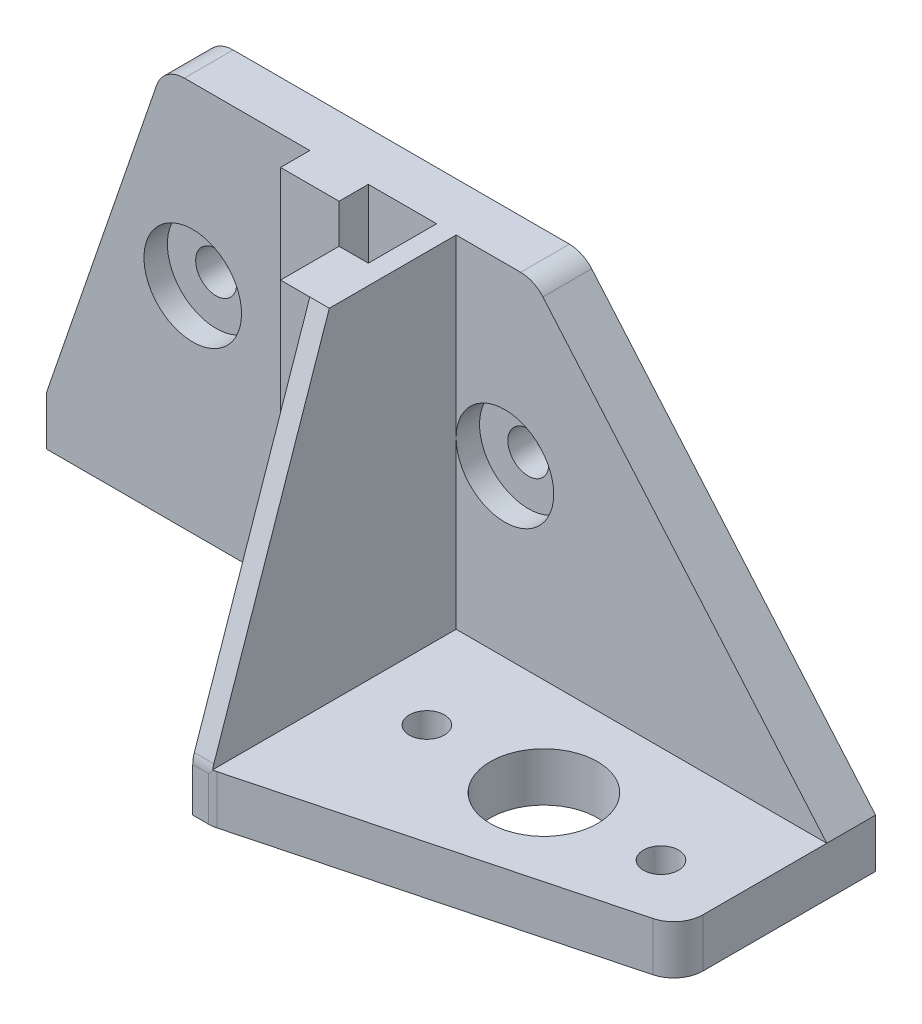
ISO-10303-21;
HEADER;
FILE_DESCRIPTION(('STEP AP214'),'2;1');
FILE_NAME('part.step','',(''),(''),'','','');
FILE_SCHEMA(('AUTOMOTIVE_DESIGN { 1 0 10303 214 1 1 1 1 }'));
ENDSEC;
DATA;
#1=APPLICATION_CONTEXT('core data for automotive mechanical design processes');
#2=APPLICATION_PROTOCOL_DEFINITION('international standard','automotive_design',2000,#1);
#3=PRODUCT_CONTEXT('',#1,'mechanical');
#4=PRODUCT('Part','Part','',(#3));
#5=PRODUCT_RELATED_PRODUCT_CATEGORY('part','',(#4));
#6=PRODUCT_DEFINITION_FORMATION('','',#4);
#7=PRODUCT_DEFINITION_CONTEXT('part definition',#1,'design');
#8=PRODUCT_DEFINITION('design','',#6,#7);
#9=PRODUCT_DEFINITION_SHAPE('','',#8);
#10=(LENGTH_UNIT() NAMED_UNIT(*) SI_UNIT(.MILLI.,.METRE.));
#11=(NAMED_UNIT(*) PLANE_ANGLE_UNIT() SI_UNIT($,.RADIAN.));
#12=(NAMED_UNIT(*) SI_UNIT($,.STERADIAN.) SOLID_ANGLE_UNIT());
#13=UNCERTAINTY_MEASURE_WITH_UNIT(LENGTH_MEASURE(1.E-05),#10,'distance_accuracy_value','');
#14=(GEOMETRIC_REPRESENTATION_CONTEXT(3) GLOBAL_UNCERTAINTY_ASSIGNED_CONTEXT((#13)) GLOBAL_UNIT_ASSIGNED_CONTEXT((#10,
#11,#12)) REPRESENTATION_CONTEXT('',''));
#15=CARTESIAN_POINT('',(0.,0.,0.));
#16=DIRECTION('',(0.,0.,1.));
#17=DIRECTION('',(1.,0.,0.));
#18=AXIS2_PLACEMENT_3D('',#15,#16,#17);
#19=CARTESIAN_POINT('',(-40.,0.,0.));
#20=DIRECTION('',(1.,0.,0.));
#21=DIRECTION('',(0.,0.,-1.));
#22=AXIS2_PLACEMENT_3D('',#19,#20,#21);
#23=PLANE('',#22);
#24=DIRECTION('',(0.,0.,-1.));
#25=VECTOR('',#24,1.);
#26=CARTESIAN_POINT('',(-40.,0.,0.));
#27=LINE('',#26,#25);
#28=CARTESIAN_POINT('',(-40.,0.,-18.));
#29=VERTEX_POINT('',#28);
#30=CARTESIAN_POINT('',(-40.,0.,-25.));
#31=VERTEX_POINT('',#30);
#32=EDGE_CURVE('E422',#29,#31,#27,.T.);
#33=ORIENTED_EDGE('',*,*,#32,.F.);
#34=DIRECTION('',(0.,-1.,0.));
#35=VECTOR('',#34,1.);
#36=CARTESIAN_POINT('',(-40.,46.7082039324994,-18.));
#37=LINE('',#36,#35);
#38=CARTESIAN_POINT('',(-40.,40.,-18.));
#39=VERTEX_POINT('',#38);
#40=EDGE_CURVE('E386',#39,#29,#37,.T.);
#41=ORIENTED_EDGE('',*,*,#40,.F.);
#42=DIRECTION('',(0.,0.,1.));
#43=VECTOR('',#42,1.);
#44=CARTESIAN_POINT('',(-40.,40.,0.));
#45=LINE('',#44,#43);
#46=CARTESIAN_POINT('',(-40.,40.,-25.));
#47=VERTEX_POINT('',#46);
#48=EDGE_CURVE('E245',#47,#39,#45,.T.);
#49=ORIENTED_EDGE('',*,*,#48,.F.);
#50=DIRECTION('',(0.,1.,0.));
#51=VECTOR('',#50,1.);
#52=CARTESIAN_POINT('',(-40.,0.,-25.));
#53=LINE('',#52,#51);
#54=EDGE_CURVE('E302',#31,#47,#53,.T.);
#55=ORIENTED_EDGE('',*,*,#54,.F.);
#56=EDGE_LOOP('',(#33,#41,#49,#55));
#57=FACE_BOUND('',#56,.T.);
#58=ADVANCED_FACE('F33',(#57),#23,.F.);
#59=CARTESIAN_POINT('',(-60.,0.,-25.));
#60=DIRECTION('',(0.,0.,-1.));
#61=DIRECTION('',(-1.,0.,0.));
#62=AXIS2_PLACEMENT_3D('',#59,#60,#61);
#63=PLANE('',#62);
#64=CARTESIAN_POINT('',(-65.,22.,-25.));
#65=DIRECTION('',(0.,0.,1.));
#66=DIRECTION('',(1.,0.,0.));
#67=AXIS2_PLACEMENT_3D('',#64,#65,#66);
#68=CIRCLE('',#67,5.);
#69=CARTESIAN_POINT('',(-60.,22.,-25.));
#70=VERTEX_POINT('',#69);
#71=EDGE_CURVE('E344',#70,#70,#68,.T.);
#72=ORIENTED_EDGE('',*,*,#71,.F.);
#73=EDGE_LOOP('',(#72));
#74=FACE_BOUND('',#73,.T.);
#75=DIRECTION('',(1.,0.,0.));
#76=VECTOR('',#75,1.);
#77=CARTESIAN_POINT('',(-40.,40.,-25.));
#78=LINE('',#77,#76);
#79=CARTESIAN_POINT('',(-65.8571428571428,40.,-25.));
#80=VERTEX_POINT('',#79);
#81=CARTESIAN_POINT('',(-53.,40.,-25.));
#82=VERTEX_POINT('',#81);
#83=EDGE_CURVE('E236',#80,#82,#78,.T.);
#84=ORIENTED_EDGE('',*,*,#83,.F.);
#85=CARTESIAN_POINT('',(-65.8571428571428,37.,-25.));
#86=DIRECTION('',(0.,0.,-1.));
#87=DIRECTION('',(-1.,0.,0.));
#88=AXIS2_PLACEMENT_3D('',#85,#86,#87);
#89=CIRCLE('',#88,3.);
#90=CARTESIAN_POINT('',(-68.6949806949807,37.972972972973,-25.));
#91=VERTEX_POINT('',#90);
#92=EDGE_CURVE('E57',#80,#91,#89,.F.);
#93=ORIENTED_EDGE('',*,*,#92,.T.);
#94=DIRECTION('',(0.324324324324322,0.945945945945947,0.));
#95=VECTOR('',#94,1.);
#96=CARTESIAN_POINT('',(-68.,40.,-25.));
#97=LINE('',#96,#95);
#98=CARTESIAN_POINT('',(-80.,5.,-25.));
#99=VERTEX_POINT('',#98);
#100=EDGE_CURVE('E214',#91,#99,#97,.F.);
#101=ORIENTED_EDGE('',*,*,#100,.T.);
#102=DIRECTION('',(0.,1.,0.));
#103=VECTOR('',#102,1.);
#104=CARTESIAN_POINT('',(-80.,-2.49999999998515E-05,-25.));
#105=LINE('',#104,#103);
#106=CARTESIAN_POINT('',(-80.,0.,-25.));
#107=VERTEX_POINT('',#106);
#108=EDGE_CURVE('E205',#107,#99,#105,.T.);
#109=ORIENTED_EDGE('',*,*,#108,.F.);
#110=DIRECTION('',(-1.,0.,0.));
#111=VECTOR('',#110,1.);
#112=CARTESIAN_POINT('',(-60.,0.,-25.));
#113=LINE('',#112,#111);
#114=CARTESIAN_POINT('',(-53.,0.,-25.));
#115=VERTEX_POINT('',#114);
#116=EDGE_CURVE('E421',#115,#107,#113,.T.);
#117=ORIENTED_EDGE('',*,*,#116,.F.);
#118=DIRECTION('',(0.,-1.,0.));
#119=VECTOR('',#118,1.);
#120=CARTESIAN_POINT('',(-53.,46.7082039324994,-25.));
#121=LINE('',#120,#119);
#122=EDGE_CURVE('E244',#82,#115,#121,.T.);
#123=ORIENTED_EDGE('',*,*,#122,.F.);
#124=EDGE_LOOP('',(#84,#93,#101,#109,#117,#123));
#125=FACE_BOUND('',#124,.T.);
#126=ADVANCED_FACE('F215',(#74,#125),#63,.F.);
#127=CARTESIAN_POINT('',(-65.,22.,5.0000000018785E-05));
#128=DIRECTION('',(0.,0.,-1.));
#129=DIRECTION('',(-1.,0.,0.));
#130=AXIS2_PLACEMENT_3D('',#127,#128,#129);
#131=CYLINDRICAL_SURFACE('',#130,2.1);
#132=CARTESIAN_POINT('',(-65.,22.,-30.));
#133=DIRECTION('',(0.,0.,-1.));
#134=DIRECTION('',(-1.,0.,0.));
#135=AXIS2_PLACEMENT_3D('',#132,#133,#134);
#136=CIRCLE('',#135,2.1);
#137=CARTESIAN_POINT('',(-67.1,22.,-30.));
#138=VERTEX_POINT('',#137);
#139=EDGE_CURVE('E332',#138,#138,#136,.T.);
#140=ORIENTED_EDGE('',*,*,#139,.T.);
#141=EDGE_LOOP('',(#140));
#142=FACE_BOUND('',#141,.T.);
#143=CARTESIAN_POINT('',(-65.,22.,-27.4));
#144=DIRECTION('',(0.,0.,1.));
#145=DIRECTION('',(1.,0.,0.));
#146=AXIS2_PLACEMENT_3D('',#143,#144,#145);
#147=CIRCLE('',#146,2.1);
#148=CARTESIAN_POINT('',(-62.9,22.,-27.4));
#149=VERTEX_POINT('',#148);
#150=EDGE_CURVE('E341',#149,#149,#147,.F.);
#151=ORIENTED_EDGE('',*,*,#150,.F.);
#152=EDGE_LOOP('',(#151));
#153=FACE_BOUND('',#152,.T.);
#154=ADVANCED_FACE('F522',(#142,#153),#131,.F.);
#155=CARTESIAN_POINT('',(-33.,22.,5.00000000153156E-05));
#156=DIRECTION('',(0.,0.,-1.));
#157=DIRECTION('',(-1.,0.,0.));
#158=AXIS2_PLACEMENT_3D('',#155,#156,#157);
#159=CYLINDRICAL_SURFACE('',#158,2.1);
#160=CARTESIAN_POINT('',(-33.,22.,-30.));
#161=DIRECTION('',(0.,0.,-1.));
#162=DIRECTION('',(-1.,0.,0.));
#163=AXIS2_PLACEMENT_3D('',#160,#161,#162);
#164=CIRCLE('',#163,2.1);
#165=CARTESIAN_POINT('',(-35.1,22.,-30.));
#166=VERTEX_POINT('',#165);
#167=EDGE_CURVE('E327',#166,#166,#164,.T.);
#168=ORIENTED_EDGE('',*,*,#167,.T.);
#169=EDGE_LOOP('',(#168));
#170=FACE_BOUND('',#169,.T.);
#171=CARTESIAN_POINT('',(-33.,22.,-27.4));
#172=DIRECTION('',(0.,0.,1.));
#173=DIRECTION('',(1.,0.,0.));
#174=AXIS2_PLACEMENT_3D('',#171,#172,#173);
#175=CIRCLE('',#174,2.1);
#176=CARTESIAN_POINT('',(-30.9,22.,-27.4));
#177=VERTEX_POINT('',#176);
#178=EDGE_CURVE('E337',#177,#177,#175,.F.);
#179=ORIENTED_EDGE('',*,*,#178,.F.);
#180=EDGE_LOOP('',(#179));
#181=FACE_BOUND('',#180,.T.);
#182=ADVANCED_FACE('F557',(#170,#181),#159,.F.);
#183=CARTESIAN_POINT('',(0.,5.,0.));
#184=DIRECTION('',(0.,1.,0.));
#185=DIRECTION('',(0.,0.,1.));
#186=AXIS2_PLACEMENT_3D('',#183,#184,#185);
#187=PLANE('',#186);
#188=CARTESIAN_POINT('',(-31.,5.,-15.));
#189=DIRECTION('',(0.,1.,0.));
#190=DIRECTION('',(0.,0.,1.));
#191=AXIS2_PLACEMENT_3D('',#188,#189,#190);
#192=CIRCLE('',#191,1.8);
#193=CARTESIAN_POINT('',(-31.,5.,-13.2));
#194=VERTEX_POINT('',#193);
#195=EDGE_CURVE('E322',#194,#194,#192,.T.);
#196=ORIENTED_EDGE('',*,*,#195,.F.);
#197=EDGE_LOOP('',(#196));
#198=FACE_BOUND('',#197,.T.);
#199=CARTESIAN_POINT('',(-7.,5.,-15.));
#200=DIRECTION('',(0.,1.,0.));
#201=DIRECTION('',(0.,0.,1.));
#202=AXIS2_PLACEMENT_3D('',#199,#200,#201);
#203=CIRCLE('',#202,1.8);
#204=CARTESIAN_POINT('',(-7.,5.,-13.2));
#205=VERTEX_POINT('',#204);
#206=EDGE_CURVE('E319',#205,#205,#203,.T.);
#207=ORIENTED_EDGE('',*,*,#206,.F.);
#208=EDGE_LOOP('',(#207));
#209=FACE_BOUND('',#208,.T.);
#210=CARTESIAN_POINT('',(-19.,5.,-15.));
#211=DIRECTION('',(0.,1.,0.));
#212=DIRECTION('',(0.,0.,1.));
#213=AXIS2_PLACEMENT_3D('',#210,#211,#212);
#214=CIRCLE('',#213,5.5);
#215=CARTESIAN_POINT('',(-19.,5.,-9.49999999999999));
#216=VERTEX_POINT('',#215);
#217=EDGE_CURVE('E253',#216,#216,#214,.T.);
#218=ORIENTED_EDGE('',*,*,#217,.F.);
#219=EDGE_LOOP('',(#218));
#220=FACE_BOUND('',#219,.T.);
#221=DIRECTION('',(0.,0.,-1.));
#222=VECTOR('',#221,1.);
#223=CARTESIAN_POINT('',(-38.,5.,-25.));
#224=LINE('',#223,#222);
#225=CARTESIAN_POINT('',(-38.,5.,-0.0419601084502422));
#226=VERTEX_POINT('',#225);
#227=CARTESIAN_POINT('',(-38.,5.,-25.));
#228=VERTEX_POINT('',#227);
#229=EDGE_CURVE('E267',#226,#228,#224,.T.);
#230=ORIENTED_EDGE('',*,*,#229,.F.);
#231=DIRECTION('',(-1.,0.,0.));
#232=VECTOR('',#231,1.);
#233=CARTESIAN_POINT('',(-38.,5.,-0.041960108450242));
#234=LINE('',#233,#232);
#235=CARTESIAN_POINT('',(-37.8881296226333,5.,-0.0419601084502411));
#236=VERTEX_POINT('',#235);
#237=EDGE_CURVE('E853',#226,#236,#234,.F.);
#238=ORIENTED_EDGE('',*,*,#237,.T.);
#239=CARTESIAN_POINT('',(-38.3881296226336,5.,-3.));
#240=DIRECTION('',(0.,1.,0.));
#241=DIRECTION('',(0.,0.,1.));
#242=AXIS2_PLACEMENT_3D('',#239,#240,#241);
#243=CIRCLE('',#242,3.);
#244=CARTESIAN_POINT('',(-37.6246497247947,5.,-0.0987763882120529));
#245=VERTEX_POINT('',#244);
#246=EDGE_CURVE('E275',#236,#245,#243,.T.);
#247=ORIENTED_EDGE('',*,*,#246,.T.);
#248=DIRECTION('',(-0.967074537262647,0.,0.254493299279641));
#249=VECTOR('',#248,1.);
#250=CARTESIAN_POINT('',(-2.46113989637303,5.,-9.35233160621764));
#251=LINE('',#250,#249);
#252=CARTESIAN_POINT('',(-2.23652010216108,5.,-9.41144207837868));
#253=VERTEX_POINT('',#252);
#254=EDGE_CURVE('E276',#245,#253,#251,.F.);
#255=ORIENTED_EDGE('',*,*,#254,.T.);
#256=CARTESIAN_POINT('',(-3.,5.,-12.3126656901666));
#257=DIRECTION('',(0.,1.,0.));
#258=DIRECTION('',(0.,0.,1.));
#259=AXIS2_PLACEMENT_3D('',#256,#257,#258);
#260=CIRCLE('',#259,3.);
#261=CARTESIAN_POINT('',(0.,5.,-12.3126656901666));
#262=VERTEX_POINT('',#261);
#263=EDGE_CURVE('E473',#253,#262,#260,.T.);
#264=ORIENTED_EDGE('',*,*,#263,.T.);
#265=DIRECTION('',(0.,0.,-1.));
#266=VECTOR('',#265,1.);
#267=CARTESIAN_POINT('',(0.,5.,0.));
#268=LINE('',#267,#266);
#269=CARTESIAN_POINT('',(0.,5.,-25.));
#270=VERTEX_POINT('',#269);
#271=EDGE_CURVE('E286',#262,#270,#268,.T.);
#272=ORIENTED_EDGE('',*,*,#271,.T.);
#273=DIRECTION('',(1.,0.,0.));
#274=VECTOR('',#273,1.);
#275=CARTESIAN_POINT('',(0.,5.,-25.));
#276=LINE('',#275,#274);
#277=EDGE_CURVE('E251',#228,#270,#276,.T.);
#278=ORIENTED_EDGE('',*,*,#277,.F.);
#279=EDGE_LOOP('',(#230,#238,#247,#255,#264,#272,#278));
#280=FACE_BOUND('',#279,.T.);
#281=ADVANCED_FACE('F560',(#198,#209,#220,#280),#187,.T.);
#282=CARTESIAN_POINT('',(0.,5.,0.));
#283=DIRECTION('',(-1.,0.,0.));
#284=DIRECTION('',(0.,0.,1.));
#285=AXIS2_PLACEMENT_3D('',#282,#283,#284);
#286=PLANE('',#285);
#287=DIRECTION('',(0.,-1.,0.));
#288=VECTOR('',#287,1.);
#289=CARTESIAN_POINT('',(0.,5.,-30.));
#290=LINE('',#289,#288);
#291=CARTESIAN_POINT('',(0.,4.99999999999984,-30.));
#292=VERTEX_POINT('',#291);
#293=CARTESIAN_POINT('',(0.,0.,-30.));
#294=VERTEX_POINT('',#293);
#295=EDGE_CURVE('E309',#292,#294,#290,.T.);
#296=ORIENTED_EDGE('',*,*,#295,.F.);
#297=DIRECTION('',(0.,0.,1.));
#298=VECTOR('',#297,1.);
#299=CARTESIAN_POINT('',(0.,4.99999999999984,0.));
#300=LINE('',#299,#298);
#301=EDGE_CURVE('E467',#292,#270,#300,.T.);
#302=ORIENTED_EDGE('',*,*,#301,.T.);
#303=ORIENTED_EDGE('',*,*,#271,.F.);
#304=DIRECTION('',(0.,1.,0.));
#305=VECTOR('',#304,1.);
#306=CARTESIAN_POINT('',(0.,0.,-12.3126656901666));
#307=LINE('',#306,#305);
#308=CARTESIAN_POINT('',(0.,0.,-12.3126656901666));
#309=VERTEX_POINT('',#308);
#310=EDGE_CURVE('E279',#262,#309,#307,.F.);
#311=ORIENTED_EDGE('',*,*,#310,.T.);
#312=DIRECTION('',(0.,0.,-1.));
#313=VECTOR('',#312,1.);
#314=CARTESIAN_POINT('',(0.,0.,0.));
#315=LINE('',#314,#313);
#316=EDGE_CURVE('E298',#309,#294,#315,.T.);
#317=ORIENTED_EDGE('',*,*,#316,.T.);
#318=EDGE_LOOP('',(#296,#302,#303,#311,#317));
#319=FACE_BOUND('',#318,.T.);
#320=ADVANCED_FACE('F490',(#319),#286,.F.);
#321=CARTESIAN_POINT('',(0.,5.,-30.));
#322=DIRECTION('',(0.,0.,1.));
#323=DIRECTION('',(1.,0.,0.));
#324=AXIS2_PLACEMENT_3D('',#321,#322,#323);
#325=PLANE('',#324);
#326=ORIENTED_EDGE('',*,*,#139,.F.);
#327=EDGE_LOOP('',(#326));
#328=FACE_BOUND('',#327,.T.);
#329=ORIENTED_EDGE('',*,*,#167,.F.);
#330=EDGE_LOOP('',(#329));
#331=FACE_BOUND('',#330,.T.);
#332=DIRECTION('',(-0.324324324324322,-0.945945945945947,0.));
#333=VECTOR('',#332,1.);
#334=CARTESIAN_POINT('',(-68.,40.,-30.));
#335=LINE('',#334,#333);
#336=CARTESIAN_POINT('',(-80.,4.9999999999996,-30.));
#337=VERTEX_POINT('',#336);
#338=CARTESIAN_POINT('',(-68.6949806949807,37.972972972973,-30.));
#339=VERTEX_POINT('',#338);
#340=EDGE_CURVE('E219',#337,#339,#335,.F.);
#341=ORIENTED_EDGE('',*,*,#340,.T.);
#342=CARTESIAN_POINT('',(-65.8571428571428,37.,-30.));
#343=DIRECTION('',(0.,0.,1.));
#344=DIRECTION('',(1.,0.,0.));
#345=AXIS2_PLACEMENT_3D('',#342,#343,#344);
#346=CIRCLE('',#345,3.);
#347=CARTESIAN_POINT('',(-65.8571428571428,40.,-30.));
#348=VERTEX_POINT('',#347);
#349=EDGE_CURVE('E11',#339,#348,#346,.F.);
#350=ORIENTED_EDGE('',*,*,#349,.T.);
#351=DIRECTION('',(-1.,0.,0.));
#352=VECTOR('',#351,1.);
#353=CARTESIAN_POINT('',(-80.,40.,-30.));
#354=LINE('',#353,#352);
#355=CARTESIAN_POINT('',(-31.3798047674113,40.,-30.));
#356=VERTEX_POINT('',#355);
#357=EDGE_CURVE('E240',#356,#348,#354,.T.);
#358=ORIENTED_EDGE('',*,*,#357,.F.);
#359=CARTESIAN_POINT('',(-31.3798047674113,37.,-30.));
#360=DIRECTION('',(0.,0.,1.));
#361=DIRECTION('',(1.,0.,0.));
#362=AXIS2_PLACEMENT_3D('',#359,#360,#361);
#363=CIRCLE('',#362,3.);
#364=CARTESIAN_POINT('',(-29.1020349603154,38.9523741203679,-30.));
#365=VERTEX_POINT('',#364);
#366=EDGE_CURVE('E458',#356,#365,#363,.F.);
#367=ORIENTED_EDGE('',*,*,#366,.T.);
#368=DIRECTION('',(-0.650791373455968,0.759256602365297,0.));
#369=VECTOR('',#368,1.);
#370=CARTESIAN_POINT('',(-30.0000000000001,40.,-30.));
#371=LINE('',#370,#369);
#372=EDGE_CURVE('E471',#365,#292,#371,.F.);
#373=ORIENTED_EDGE('',*,*,#372,.T.);
#374=ORIENTED_EDGE('',*,*,#295,.T.);
#375=DIRECTION('',(-1.,0.,0.));
#376=VECTOR('',#375,1.);
#377=CARTESIAN_POINT('',(0.,0.,-30.));
#378=LINE('',#377,#376);
#379=CARTESIAN_POINT('',(-80.,0.,-30.));
#380=VERTEX_POINT('',#379);
#381=EDGE_CURVE('E301',#294,#380,#378,.T.);
#382=ORIENTED_EDGE('',*,*,#381,.T.);
#383=DIRECTION('',(0.,-1.,0.));
#384=VECTOR('',#383,1.);
#385=CARTESIAN_POINT('',(-80.,5.,-30.));
#386=LINE('',#385,#384);
#387=EDGE_CURVE('E290',#337,#380,#386,.T.);
#388=ORIENTED_EDGE('',*,*,#387,.F.);
#389=EDGE_LOOP('',(#341,#350,#358,#367,#373,#374,#382,#388));
#390=FACE_BOUND('',#389,.T.);
#391=ADVANCED_FACE('F495',(#328,#331,#390),#325,.F.);
#392=CARTESIAN_POINT('',(-80.,5.,0.));
#393=DIRECTION('',(1.,0.,0.));
#394=DIRECTION('',(0.,0.,-1.));
#395=AXIS2_PLACEMENT_3D('',#392,#393,#394);
#396=PLANE('',#395);
#397=DIRECTION('',(0.,0.,1.));
#398=VECTOR('',#397,1.);
#399=CARTESIAN_POINT('',(-80.,0.,0.));
#400=LINE('',#399,#398);
#401=EDGE_CURVE('E211',#380,#107,#400,.T.);
#402=ORIENTED_EDGE('',*,*,#401,.T.);
#403=ORIENTED_EDGE('',*,*,#108,.T.);
#404=DIRECTION('',(0.,0.,-1.));
#405=VECTOR('',#404,1.);
#406=CARTESIAN_POINT('',(-80.,4.99999999999962,0.));
#407=LINE('',#406,#405);
#408=EDGE_CURVE('E208',#99,#337,#407,.T.);
#409=ORIENTED_EDGE('',*,*,#408,.T.);
#410=ORIENTED_EDGE('',*,*,#387,.T.);
#411=EDGE_LOOP('',(#402,#403,#409,#410));
#412=FACE_BOUND('',#411,.T.);
#413=ADVANCED_FACE('F206',(#412),#396,.F.);
#414=CARTESIAN_POINT('',(0.,5.,0.));
#415=DIRECTION('',(0.,0.,-1.));
#416=DIRECTION('',(-1.,0.,0.));
#417=AXIS2_PLACEMENT_3D('',#414,#415,#416);
#418=PLANE('',#417);
#419=DIRECTION('',(0.,-1.,0.));
#420=VECTOR('',#419,1.);
#421=CARTESIAN_POINT('',(-38.3881296226336,5.,0.));
#422=LINE('',#421,#420);
#423=CARTESIAN_POINT('',(-38.3881296226336,0.,0.));
#424=VERTEX_POINT('',#423);
#425=CARTESIAN_POINT('',(-38.3881296226336,4.49999999999968,0.));
#426=VERTEX_POINT('',#425);
#427=EDGE_CURVE('E439',#424,#426,#422,.F.);
#428=ORIENTED_EDGE('',*,*,#427,.T.);
#429=DIRECTION('',(1.,0.,0.));
#430=VECTOR('',#429,1.);
#431=CARTESIAN_POINT('',(-40.,4.49999999999968,0.));
#432=LINE('',#431,#430);
#433=CARTESIAN_POINT('',(-40.,4.49999999999968,0.));
#434=VERTEX_POINT('',#433);
#435=EDGE_CURVE('E438',#426,#434,#432,.F.);
#436=ORIENTED_EDGE('',*,*,#435,.T.);
#437=DIRECTION('',(0.,1.,0.));
#438=VECTOR('',#437,1.);
#439=CARTESIAN_POINT('',(-40.,0.,0.));
#440=LINE('',#439,#438);
#441=CARTESIAN_POINT('',(-40.,0.,0.));
#442=VERTEX_POINT('',#441);
#443=EDGE_CURVE('E296',#442,#434,#440,.T.);
#444=ORIENTED_EDGE('',*,*,#443,.F.);
#445=DIRECTION('',(1.,0.,0.));
#446=VECTOR('',#445,1.);
#447=CARTESIAN_POINT('',(0.,0.,0.));
#448=LINE('',#447,#446);
#449=EDGE_CURVE('E291',#442,#424,#448,.T.);
#450=ORIENTED_EDGE('',*,*,#449,.T.);
#451=EDGE_LOOP('',(#428,#436,#444,#450));
#452=FACE_BOUND('',#451,.T.);
#453=ADVANCED_FACE('F435',(#452),#418,.F.);
#454=CARTESIAN_POINT('',(0.,0.,0.));
#455=DIRECTION('',(0.,1.,0.));
#456=DIRECTION('',(0.,0.,1.));
#457=AXIS2_PLACEMENT_3D('',#454,#455,#456);
#458=PLANE('',#457);
#459=CARTESIAN_POINT('',(-31.,0.,-15.));
#460=DIRECTION('',(0.,1.,0.));
#461=DIRECTION('',(0.,0.,1.));
#462=AXIS2_PLACEMENT_3D('',#459,#460,#461);
#463=CIRCLE('',#462,1.8);
#464=CARTESIAN_POINT('',(-31.,0.,-13.2));
#465=VERTEX_POINT('',#464);
#466=EDGE_CURVE('E320',#465,#465,#463,.T.);
#467=ORIENTED_EDGE('',*,*,#466,.T.);
#468=EDGE_LOOP('',(#467));
#469=FACE_BOUND('',#468,.T.);
#470=CARTESIAN_POINT('',(-7.,0.,-15.));
#471=DIRECTION('',(0.,1.,0.));
#472=DIRECTION('',(0.,0.,1.));
#473=AXIS2_PLACEMENT_3D('',#470,#471,#472);
#474=CIRCLE('',#473,1.8);
#475=CARTESIAN_POINT('',(-7.,0.,-13.2));
#476=VERTEX_POINT('',#475);
#477=EDGE_CURVE('E317',#476,#476,#474,.T.);
#478=ORIENTED_EDGE('',*,*,#477,.T.);
#479=EDGE_LOOP('',(#478));
#480=FACE_BOUND('',#479,.T.);
#481=CARTESIAN_POINT('',(-19.,0.,-15.));
#482=DIRECTION('',(0.,1.,0.));
#483=DIRECTION('',(0.,0.,1.));
#484=AXIS2_PLACEMENT_3D('',#481,#482,#483);
#485=CIRCLE('',#484,5.5);
#486=CARTESIAN_POINT('',(-19.,0.,-9.49999999999999));
#487=VERTEX_POINT('',#486);
#488=EDGE_CURVE('E270',#487,#487,#485,.T.);
#489=ORIENTED_EDGE('',*,*,#488,.T.);
#490=EDGE_LOOP('',(#489));
#491=FACE_BOUND('',#490,.T.);
#492=ORIENTED_EDGE('',*,*,#116,.T.);
#493=ORIENTED_EDGE('',*,*,#401,.F.);
#494=ORIENTED_EDGE('',*,*,#381,.F.);
#495=ORIENTED_EDGE('',*,*,#316,.F.);
#496=CARTESIAN_POINT('',(-3.,0.,-12.3126656901666));
#497=DIRECTION('',(0.,1.,0.));
#498=DIRECTION('',(0.,0.,1.));
#499=AXIS2_PLACEMENT_3D('',#496,#497,#498);
#500=CIRCLE('',#499,3.);
#501=CARTESIAN_POINT('',(-2.23652010216108,0.,-9.41144207837868));
#502=VERTEX_POINT('',#501);
#503=EDGE_CURVE('E481',#309,#502,#500,.F.);
#504=ORIENTED_EDGE('',*,*,#503,.T.);
#505=DIRECTION('',(0.967074537262647,0.,-0.254493299279641));
#506=VECTOR('',#505,1.);
#507=CARTESIAN_POINT('',(0.,0.,-10.));
#508=LINE('',#507,#506);
#509=CARTESIAN_POINT('',(-37.6246497247947,0.,-0.0987763882120529));
#510=VERTEX_POINT('',#509);
#511=EDGE_CURVE('E280',#502,#510,#508,.F.);
#512=ORIENTED_EDGE('',*,*,#511,.T.);
#513=CARTESIAN_POINT('',(-38.3881296226336,0.,-3.));
#514=DIRECTION('',(0.,1.,0.));
#515=DIRECTION('',(0.,0.,1.));
#516=AXIS2_PLACEMENT_3D('',#513,#514,#515);
#517=CIRCLE('',#516,3.);
#518=EDGE_CURVE('E216',#510,#424,#517,.F.);
#519=ORIENTED_EDGE('',*,*,#518,.T.);
#520=ORIENTED_EDGE('',*,*,#449,.F.);
#521=CARTESIAN_POINT('',(-40.,0.,-12.));
#522=VERTEX_POINT('',#521);
#523=EDGE_CURVE('E414',#442,#522,#27,.T.);
#524=ORIENTED_EDGE('',*,*,#523,.T.);
#525=DIRECTION('',(-1.,0.,0.));
#526=VECTOR('',#525,1.);
#527=CARTESIAN_POINT('',(-40.,0.,-12.));
#528=LINE('',#527,#526);
#529=CARTESIAN_POINT('',(-43.,0.,-12.));
#530=VERTEX_POINT('',#529);
#531=EDGE_CURVE('E394',#522,#530,#528,.T.);
#532=ORIENTED_EDGE('',*,*,#531,.T.);
#533=DIRECTION('',(0.,0.,-1.));
#534=VECTOR('',#533,1.);
#535=CARTESIAN_POINT('',(-43.,0.,-12.));
#536=LINE('',#535,#534);
#537=CARTESIAN_POINT('',(-43.,0.,-18.));
#538=VERTEX_POINT('',#537);
#539=EDGE_CURVE('E391',#530,#538,#536,.T.);
#540=ORIENTED_EDGE('',*,*,#539,.T.);
#541=DIRECTION('',(1.,0.,0.));
#542=VECTOR('',#541,1.);
#543=CARTESIAN_POINT('',(-40.,0.,-18.));
#544=LINE('',#543,#542);
#545=EDGE_CURVE('E382',#538,#29,#544,.T.);
#546=ORIENTED_EDGE('',*,*,#545,.T.);
#547=ORIENTED_EDGE('',*,*,#32,.T.);
#548=CARTESIAN_POINT('',(-47.,0.,-25.));
#549=VERTEX_POINT('',#548);
#550=EDGE_CURVE('E423',#31,#549,#113,.T.);
#551=ORIENTED_EDGE('',*,*,#550,.T.);
#552=DIRECTION('',(0.,0.,1.));
#553=VECTOR('',#552,1.);
#554=CARTESIAN_POINT('',(-47.,0.,-25.));
#555=LINE('',#554,#553);
#556=CARTESIAN_POINT('',(-47.,0.,-22.));
#557=VERTEX_POINT('',#556);
#558=EDGE_CURVE('E363',#549,#557,#555,.T.);
#559=ORIENTED_EDGE('',*,*,#558,.T.);
#560=DIRECTION('',(-1.,0.,0.));
#561=VECTOR('',#560,1.);
#562=CARTESIAN_POINT('',(-53.,0.,-22.));
#563=LINE('',#562,#561);
#564=CARTESIAN_POINT('',(-53.,0.,-22.));
#565=VERTEX_POINT('',#564);
#566=EDGE_CURVE('E353',#557,#565,#563,.T.);
#567=ORIENTED_EDGE('',*,*,#566,.T.);
#568=DIRECTION('',(0.,0.,-1.));
#569=VECTOR('',#568,1.);
#570=CARTESIAN_POINT('',(-53.,0.,-25.));
#571=LINE('',#570,#569);
#572=EDGE_CURVE('E366',#565,#115,#571,.T.);
#573=ORIENTED_EDGE('',*,*,#572,.T.);
#574=EDGE_LOOP('',(#492,#493,#494,#495,#504,#512,#519,#520,#524,#532,#540,#546,#547,#551,#559,
#567,#573));
#575=FACE_BOUND('',#574,.T.);
#576=ADVANCED_FACE('F420',(#469,#480,#491,#575),#458,.F.);
#577=CARTESIAN_POINT('',(-47.,40.,-25.));
#578=VERTEX_POINT('',#577);
#579=EDGE_CURVE('E246',#578,#47,#78,.T.);
#580=ORIENTED_EDGE('',*,*,#579,.F.);
#581=DIRECTION('',(0.,-1.,0.));
#582=VECTOR('',#581,1.);
#583=CARTESIAN_POINT('',(-47.,46.7082039324994,-25.));
#584=LINE('',#583,#582);
#585=EDGE_CURVE('E352',#578,#549,#584,.T.);
#586=ORIENTED_EDGE('',*,*,#585,.T.);
#587=ORIENTED_EDGE('',*,*,#550,.F.);
#588=ORIENTED_EDGE('',*,*,#54,.T.);
#589=EDGE_LOOP('',(#580,#586,#587,#588));
#590=FACE_BOUND('',#589,.T.);
#591=ADVANCED_FACE('F525',(#590),#63,.F.);
#592=ORIENTED_EDGE('',*,*,#443,.T.);
#593=CARTESIAN_POINT('',(-40.,4.49999999999968,-3.));
#594=DIRECTION('',(1.,0.,0.));
#595=DIRECTION('',(0.,0.,-1.));
#596=AXIS2_PLACEMENT_3D('',#593,#594,#595);
#597=CIRCLE('',#596,3.);
#598=CARTESIAN_POINT('',(-40.,5.47297297297265,-0.162162162162157));
#599=VERTEX_POINT('',#598);
#600=EDGE_CURVE('E432',#434,#599,#597,.F.);
#601=ORIENTED_EDGE('',*,*,#600,.T.);
#602=DIRECTION('',(0.,-0.945945945945947,0.324324324324322));
#603=VECTOR('',#602,1.);
#604=CARTESIAN_POINT('',(-40.,40.,-12.));
#605=LINE('',#604,#603);
#606=CARTESIAN_POINT('',(-40.,40.,-12.));
#607=VERTEX_POINT('',#606);
#608=EDGE_CURVE('E417',#599,#607,#605,.F.);
#609=ORIENTED_EDGE('',*,*,#608,.T.);
#610=DIRECTION('',(0.,-1.,0.));
#611=VECTOR('',#610,1.);
#612=CARTESIAN_POINT('',(-40.,46.7082039324994,-12.));
#613=LINE('',#612,#611);
#614=EDGE_CURVE('E378',#607,#522,#613,.T.);
#615=ORIENTED_EDGE('',*,*,#614,.T.);
#616=ORIENTED_EDGE('',*,*,#523,.F.);
#617=EDGE_LOOP('',(#592,#601,#609,#615,#616));
#618=FACE_BOUND('',#617,.T.);
#619=ADVANCED_FACE('F413',(#618),#23,.F.);
#620=CARTESIAN_POINT('',(-38.,40.,-25.));
#621=DIRECTION('',(-1.,0.,0.));
#622=DIRECTION('',(0.,0.,1.));
#623=AXIS2_PLACEMENT_3D('',#620,#621,#622);
#624=PLANE('',#623);
#625=DIRECTION('',(0.,0.945945945945947,-0.324324324324322));
#626=VECTOR('',#625,1.);
#627=CARTESIAN_POINT('',(-38.,40.,-12.));
#628=LINE('',#627,#626);
#629=CARTESIAN_POINT('',(-38.,40.,-12.));
#630=VERTEX_POINT('',#629);
#631=CARTESIAN_POINT('',(-38.,5.47297297297263,-0.162162162162156));
#632=VERTEX_POINT('',#631);
#633=EDGE_CURVE('E447',#630,#632,#628,.F.);
#634=ORIENTED_EDGE('',*,*,#633,.T.);
#635=CARTESIAN_POINT('',(-38.,4.49999999999968,-3.));
#636=DIRECTION('',(-1.,0.,0.));
#637=DIRECTION('',(0.,0.,1.));
#638=AXIS2_PLACEMENT_3D('',#635,#636,#637);
#639=CIRCLE('',#638,3.);
#640=EDGE_CURVE('E273',#632,#226,#639,.F.);
#641=ORIENTED_EDGE('',*,*,#640,.T.);
#642=ORIENTED_EDGE('',*,*,#229,.T.);
#643=DIRECTION('',(0.,-1.,0.));
#644=VECTOR('',#643,1.);
#645=CARTESIAN_POINT('',(-38.,40.,-25.));
#646=LINE('',#645,#644);
#647=CARTESIAN_POINT('',(-38.,22.,-25.));
#648=VERTEX_POINT('',#647);
#649=EDGE_CURVE('E261',#648,#228,#646,.T.);
#650=ORIENTED_EDGE('',*,*,#649,.F.);
#651=CARTESIAN_POINT('',(-38.,40.,-25.));
#652=VERTEX_POINT('',#651);
#653=EDGE_CURVE('E264',#652,#648,#646,.T.);
#654=ORIENTED_EDGE('',*,*,#653,.F.);
#655=DIRECTION('',(0.,0.,-1.));
#656=VECTOR('',#655,1.);
#657=CARTESIAN_POINT('',(-38.,40.,-25.));
#658=LINE('',#657,#656);
#659=EDGE_CURVE('E249',#630,#652,#658,.T.);
#660=ORIENTED_EDGE('',*,*,#659,.F.);
#661=EDGE_LOOP('',(#634,#641,#642,#650,#654,#660));
#662=FACE_BOUND('',#661,.T.);
#663=ADVANCED_FACE('F529',(#662),#624,.F.);
#664=CARTESIAN_POINT('',(0.,40.,-25.));
#665=DIRECTION('',(0.,0.,-1.));
#666=DIRECTION('',(-1.,0.,0.));
#667=AXIS2_PLACEMENT_3D('',#664,#665,#666);
#668=PLANE('',#667);
#669=DIRECTION('',(0.650791373455968,-0.759256602365297,0.));
#670=VECTOR('',#669,1.);
#671=CARTESIAN_POINT('',(-30.0000000000001,40.,-25.));
#672=LINE('',#671,#670);
#673=CARTESIAN_POINT('',(-29.1020349603154,38.9523741203679,-25.));
#674=VERTEX_POINT('',#673);
#675=EDGE_CURVE('E462',#270,#674,#672,.F.);
#676=ORIENTED_EDGE('',*,*,#675,.T.);
#677=CARTESIAN_POINT('',(-31.3798047674113,37.,-25.));
#678=DIRECTION('',(0.,0.,-1.));
#679=DIRECTION('',(-1.,0.,0.));
#680=AXIS2_PLACEMENT_3D('',#677,#678,#679);
#681=CIRCLE('',#680,3.);
#682=CARTESIAN_POINT('',(-31.3798047674113,40.,-25.));
#683=VERTEX_POINT('',#682);
#684=EDGE_CURVE('E454',#674,#683,#681,.F.);
#685=ORIENTED_EDGE('',*,*,#684,.T.);
#686=DIRECTION('',(1.,0.,0.));
#687=VECTOR('',#686,1.);
#688=CARTESIAN_POINT('',(0.,40.,-25.));
#689=LINE('',#688,#687);
#690=EDGE_CURVE('E257',#652,#683,#689,.T.);
#691=ORIENTED_EDGE('',*,*,#690,.F.);
#692=ORIENTED_EDGE('',*,*,#653,.T.);
#693=CARTESIAN_POINT('',(-33.,22.,-25.));
#694=DIRECTION('',(0.,0.,1.));
#695=DIRECTION('',(1.,0.,0.));
#696=AXIS2_PLACEMENT_3D('',#693,#694,#695);
#697=CIRCLE('',#696,5.);
#698=EDGE_CURVE('E338',#648,#648,#697,.T.);
#699=ORIENTED_EDGE('',*,*,#698,.F.);
#700=ORIENTED_EDGE('',*,*,#649,.T.);
#701=ORIENTED_EDGE('',*,*,#277,.T.);
#702=EDGE_LOOP('',(#676,#685,#691,#692,#699,#700,#701));
#703=FACE_BOUND('',#702,.T.);
#704=ADVANCED_FACE('F504',(#703),#668,.F.);
#705=CARTESIAN_POINT('',(0.,40.,0.));
#706=DIRECTION('',(0.,-1.,0.));
#707=DIRECTION('',(0.,0.,-1.));
#708=AXIS2_PLACEMENT_3D('',#705,#706,#707);
#709=PLANE('',#708);
#710=ORIENTED_EDGE('',*,*,#357,.T.);
#711=DIRECTION('',(0.,0.,-1.));
#712=VECTOR('',#711,1.);
#713=CARTESIAN_POINT('',(-65.8571428571428,40.,-25.));
#714=LINE('',#713,#712);
#715=EDGE_CURVE('E221',#348,#80,#714,.F.);
#716=ORIENTED_EDGE('',*,*,#715,.T.);
#717=ORIENTED_EDGE('',*,*,#83,.T.);
#718=DIRECTION('',(0.,0.,1.));
#719=VECTOR('',#718,1.);
#720=CARTESIAN_POINT('',(-53.,40.,-25.));
#721=LINE('',#720,#719);
#722=CARTESIAN_POINT('',(-53.,40.,-22.));
#723=VERTEX_POINT('',#722);
#724=EDGE_CURVE('E348',#82,#723,#721,.T.);
#725=ORIENTED_EDGE('',*,*,#724,.T.);
#726=DIRECTION('',(1.,0.,0.));
#727=VECTOR('',#726,1.);
#728=CARTESIAN_POINT('',(-53.,40.,-22.));
#729=LINE('',#728,#727);
#730=CARTESIAN_POINT('',(-47.,40.,-22.));
#731=VERTEX_POINT('',#730);
#732=EDGE_CURVE('E371',#723,#731,#729,.T.);
#733=ORIENTED_EDGE('',*,*,#732,.T.);
#734=DIRECTION('',(0.,0.,-1.));
#735=VECTOR('',#734,1.);
#736=CARTESIAN_POINT('',(-47.,40.,-25.));
#737=LINE('',#736,#735);
#738=EDGE_CURVE('E360',#731,#578,#737,.T.);
#739=ORIENTED_EDGE('',*,*,#738,.T.);
#740=ORIENTED_EDGE('',*,*,#579,.T.);
#741=ORIENTED_EDGE('',*,*,#48,.T.);
#742=DIRECTION('',(-1.,0.,0.));
#743=VECTOR('',#742,1.);
#744=CARTESIAN_POINT('',(-40.,40.,-18.));
#745=LINE('',#744,#743);
#746=CARTESIAN_POINT('',(-43.,40.,-18.));
#747=VERTEX_POINT('',#746);
#748=EDGE_CURVE('E377',#39,#747,#745,.T.);
#749=ORIENTED_EDGE('',*,*,#748,.T.);
#750=DIRECTION('',(0.,0.,1.));
#751=VECTOR('',#750,1.);
#752=CARTESIAN_POINT('',(-43.,40.,-12.));
#753=LINE('',#752,#751);
#754=CARTESIAN_POINT('',(-43.,40.,-12.));
#755=VERTEX_POINT('',#754);
#756=EDGE_CURVE('E388',#747,#755,#753,.T.);
#757=ORIENTED_EDGE('',*,*,#756,.T.);
#758=DIRECTION('',(1.,0.,0.));
#759=VECTOR('',#758,1.);
#760=CARTESIAN_POINT('',(-40.,40.,-12.));
#761=LINE('',#760,#759);
#762=EDGE_CURVE('E369',#755,#607,#761,.T.);
#763=ORIENTED_EDGE('',*,*,#762,.T.);
#764=DIRECTION('',(1.,0.,0.));
#765=VECTOR('',#764,1.);
#766=CARTESIAN_POINT('',(0.,40.,-12.));
#767=LINE('',#766,#765);
#768=EDGE_CURVE('E452',#607,#630,#767,.T.);
#769=ORIENTED_EDGE('',*,*,#768,.T.);
#770=ORIENTED_EDGE('',*,*,#659,.T.);
#771=ORIENTED_EDGE('',*,*,#690,.T.);
#772=DIRECTION('',(0.,0.,1.));
#773=VECTOR('',#772,1.);
#774=CARTESIAN_POINT('',(-31.3798047674113,40.,-30.));
#775=LINE('',#774,#773);
#776=EDGE_CURVE('E460',#683,#356,#775,.F.);
#777=ORIENTED_EDGE('',*,*,#776,.T.);
#778=EDGE_LOOP('',(#710,#716,#717,#725,#733,#739,#740,#741,#749,#757,#763,#769,#770,#771,#777));
#779=FACE_BOUND('',#778,.T.);
#780=ADVANCED_FACE('F235',(#779),#709,.F.);
#781=CARTESIAN_POINT('',(-19.,-2.49999999998515E-05,-15.));
#782=DIRECTION('',(0.,1.,0.));
#783=DIRECTION('',(0.,0.,1.));
#784=AXIS2_PLACEMENT_3D('',#781,#782,#783);
#785=CYLINDRICAL_SURFACE('',#784,5.5);
#786=ORIENTED_EDGE('',*,*,#217,.T.);
#787=EDGE_LOOP('',(#786));
#788=FACE_BOUND('',#787,.T.);
#789=ORIENTED_EDGE('',*,*,#488,.F.);
#790=EDGE_LOOP('',(#789));
#791=FACE_BOUND('',#790,.T.);
#792=ADVANCED_FACE('F545',(#788,#791),#785,.F.);
#793=CARTESIAN_POINT('',(-7.,-2.49999999998515E-05,-15.));
#794=DIRECTION('',(0.,1.,0.));
#795=DIRECTION('',(0.,0.,1.));
#796=AXIS2_PLACEMENT_3D('',#793,#794,#795);
#797=CYLINDRICAL_SURFACE('',#796,1.8);
#798=ORIENTED_EDGE('',*,*,#206,.T.);
#799=EDGE_LOOP('',(#798));
#800=FACE_BOUND('',#799,.T.);
#801=ORIENTED_EDGE('',*,*,#477,.F.);
#802=EDGE_LOOP('',(#801));
#803=FACE_BOUND('',#802,.T.);
#804=ADVANCED_FACE('F548',(#800,#803),#797,.F.);
#805=CARTESIAN_POINT('',(-31.,-2.49999999998515E-05,-15.));
#806=DIRECTION('',(0.,1.,0.));
#807=DIRECTION('',(0.,0.,1.));
#808=AXIS2_PLACEMENT_3D('',#805,#806,#807);
#809=CYLINDRICAL_SURFACE('',#808,1.8);
#810=ORIENTED_EDGE('',*,*,#195,.T.);
#811=EDGE_LOOP('',(#810));
#812=FACE_BOUND('',#811,.T.);
#813=ORIENTED_EDGE('',*,*,#466,.F.);
#814=EDGE_LOOP('',(#813));
#815=FACE_BOUND('',#814,.T.);
#816=ADVANCED_FACE('F552',(#812,#815),#809,.F.);
#817=CARTESIAN_POINT('',(0.,5.,-10.));
#818=DIRECTION('',(-0.254493299279641,0.,-0.967074537262647));
#819=DIRECTION('',(0.,-1.,0.));
#820=AXIS2_PLACEMENT_3D('',#817,#818,#819);
#821=PLANE('',#820);
#822=ORIENTED_EDGE('',*,*,#254,.F.);
#823=DIRECTION('',(0.,1.,0.));
#824=VECTOR('',#823,1.);
#825=CARTESIAN_POINT('',(-37.6246497247947,0.,-0.0987763882120545));
#826=LINE('',#825,#824);
#827=EDGE_CURVE('E848',#245,#510,#826,.F.);
#828=ORIENTED_EDGE('',*,*,#827,.T.);
#829=ORIENTED_EDGE('',*,*,#511,.F.);
#830=DIRECTION('',(0.,-1.,0.));
#831=VECTOR('',#830,1.);
#832=CARTESIAN_POINT('',(-2.23652010216108,5.,-9.41144207837868));
#833=LINE('',#832,#831);
#834=EDGE_CURVE('E479',#502,#253,#833,.F.);
#835=ORIENTED_EDGE('',*,*,#834,.T.);
#836=EDGE_LOOP('',(#822,#828,#829,#835));
#837=FACE_BOUND('',#836,.T.);
#838=ADVANCED_FACE('F556',(#837),#821,.F.);
#839=CARTESIAN_POINT('',(-3.,5.,-12.3126656901666));
#840=DIRECTION('',(0.,-1.,0.));
#841=DIRECTION('',(0.,0.,-1.));
#842=AXIS2_PLACEMENT_3D('',#839,#840,#841);
#843=CYLINDRICAL_SURFACE('',#842,3.);
#844=ORIENTED_EDGE('',*,*,#263,.F.);
#845=ORIENTED_EDGE('',*,*,#834,.F.);
#846=ORIENTED_EDGE('',*,*,#503,.F.);
#847=ORIENTED_EDGE('',*,*,#310,.F.);
#848=EDGE_LOOP('',(#844,#845,#846,#847));
#849=FACE_BOUND('',#848,.T.);
#850=ADVANCED_FACE('F573',(#849),#843,.T.);
#851=CARTESIAN_POINT('',(-33.,22.,-27.4));
#852=DIRECTION('',(0.,0.,1.));
#853=DIRECTION('',(1.,0.,0.));
#854=AXIS2_PLACEMENT_3D('',#851,#852,#853);
#855=PLANE('',#854);
#856=CARTESIAN_POINT('',(-33.,22.,-27.4));
#857=DIRECTION('',(0.,0.,1.));
#858=DIRECTION('',(1.,0.,0.));
#859=AXIS2_PLACEMENT_3D('',#856,#857,#858);
#860=CIRCLE('',#859,5.);
#861=CARTESIAN_POINT('',(-28.,22.,-27.4));
#862=VERTEX_POINT('',#861);
#863=EDGE_CURVE('E340',#862,#862,#860,.T.);
#864=ORIENTED_EDGE('',*,*,#863,.T.);
#865=EDGE_LOOP('',(#864));
#866=FACE_BOUND('',#865,.T.);
#867=ORIENTED_EDGE('',*,*,#178,.T.);
#868=EDGE_LOOP('',(#867));
#869=FACE_BOUND('',#868,.T.);
#870=ADVANCED_FACE('F569',(#866,#869),#855,.T.);
#871=CARTESIAN_POINT('',(-33.,22.,-27.4));
#872=DIRECTION('',(0.,0.,1.));
#873=DIRECTION('',(1.,0.,0.));
#874=AXIS2_PLACEMENT_3D('',#871,#872,#873);
#875=CYLINDRICAL_SURFACE('',#874,5.);
#876=ORIENTED_EDGE('',*,*,#863,.F.);
#877=EDGE_LOOP('',(#876));
#878=FACE_BOUND('',#877,.T.);
#879=ORIENTED_EDGE('',*,*,#698,.T.);
#880=EDGE_LOOP('',(#879));
#881=FACE_BOUND('',#880,.T.);
#882=ADVANCED_FACE('F565',(#878,#881),#875,.F.);
#883=CARTESIAN_POINT('',(-65.,22.,-27.4));
#884=DIRECTION('',(0.,0.,1.));
#885=DIRECTION('',(1.,0.,0.));
#886=AXIS2_PLACEMENT_3D('',#883,#884,#885);
#887=PLANE('',#886);
#888=CARTESIAN_POINT('',(-65.,22.,-27.4));
#889=DIRECTION('',(0.,0.,1.));
#890=DIRECTION('',(1.,0.,0.));
#891=AXIS2_PLACEMENT_3D('',#888,#889,#890);
#892=CIRCLE('',#891,5.);
#893=CARTESIAN_POINT('',(-60.,22.,-27.4));
#894=VERTEX_POINT('',#893);
#895=EDGE_CURVE('E347',#894,#894,#892,.T.);
#896=ORIENTED_EDGE('',*,*,#895,.T.);
#897=EDGE_LOOP('',(#896));
#898=FACE_BOUND('',#897,.T.);
#899=ORIENTED_EDGE('',*,*,#150,.T.);
#900=EDGE_LOOP('',(#899));
#901=FACE_BOUND('',#900,.T.);
#902=ADVANCED_FACE('F568',(#898,#901),#887,.T.);
#903=CARTESIAN_POINT('',(-65.,22.,-27.4));
#904=DIRECTION('',(0.,0.,1.));
#905=DIRECTION('',(1.,0.,0.));
#906=AXIS2_PLACEMENT_3D('',#903,#904,#905);
#907=CYLINDRICAL_SURFACE('',#906,5.);
#908=ORIENTED_EDGE('',*,*,#895,.F.);
#909=EDGE_LOOP('',(#908));
#910=FACE_BOUND('',#909,.T.);
#911=ORIENTED_EDGE('',*,*,#71,.T.);
#912=EDGE_LOOP('',(#911));
#913=FACE_BOUND('',#912,.T.);
#914=ADVANCED_FACE('F575',(#910,#913),#907,.F.);
#915=CARTESIAN_POINT('',(-30.0000000000001,40.,0.));
#916=DIRECTION('',(-0.759256602365297,-0.650791373455968,0.));
#917=DIRECTION('',(0.,0.,-1.));
#918=AXIS2_PLACEMENT_3D('',#915,#916,#917);
#919=PLANE('',#918);
#920=ORIENTED_EDGE('',*,*,#372,.F.);
#921=DIRECTION('',(0.,0.,-1.));
#922=VECTOR('',#921,1.);
#923=CARTESIAN_POINT('',(-29.1020349603154,38.9523741203679,-25.));
#924=LINE('',#923,#922);
#925=EDGE_CURVE('E456',#365,#674,#924,.F.);
#926=ORIENTED_EDGE('',*,*,#925,.T.);
#927=ORIENTED_EDGE('',*,*,#675,.F.);
#928=ORIENTED_EDGE('',*,*,#301,.F.);
#929=EDGE_LOOP('',(#920,#926,#927,#928));
#930=FACE_BOUND('',#929,.T.);
#931=ADVANCED_FACE('F500',(#930),#919,.F.);
#932=CARTESIAN_POINT('',(-31.3798047674113,37.,0.));
#933=DIRECTION('',(0.,0.,-1.));
#934=DIRECTION('',(-1.,0.,0.));
#935=AXIS2_PLACEMENT_3D('',#932,#933,#934);
#936=CYLINDRICAL_SURFACE('',#935,3.);
#937=ORIENTED_EDGE('',*,*,#684,.F.);
#938=ORIENTED_EDGE('',*,*,#925,.F.);
#939=ORIENTED_EDGE('',*,*,#366,.F.);
#940=ORIENTED_EDGE('',*,*,#776,.F.);
#941=EDGE_LOOP('',(#937,#938,#939,#940));
#942=FACE_BOUND('',#941,.T.);
#943=ADVANCED_FACE('F510',(#942),#936,.T.);
#944=CARTESIAN_POINT('',(-53.,46.7082039324994,-25.));
#945=DIRECTION('',(-1.,0.,0.));
#946=DIRECTION('',(0.,0.,1.));
#947=AXIS2_PLACEMENT_3D('',#944,#945,#946);
#948=PLANE('',#947);
#949=ORIENTED_EDGE('',*,*,#724,.F.);
#950=ORIENTED_EDGE('',*,*,#122,.T.);
#951=ORIENTED_EDGE('',*,*,#572,.F.);
#952=DIRECTION('',(0.,-1.,0.));
#953=VECTOR('',#952,1.);
#954=CARTESIAN_POINT('',(-53.,46.7082039324994,-22.));
#955=LINE('',#954,#953);
#956=EDGE_CURVE('E358',#723,#565,#955,.T.);
#957=ORIENTED_EDGE('',*,*,#956,.F.);
#958=EDGE_LOOP('',(#949,#950,#951,#957));
#959=FACE_BOUND('',#958,.T.);
#960=ADVANCED_FACE('F582',(#959),#948,.T.);
#961=CARTESIAN_POINT('',(-53.,46.7082039324994,-22.));
#962=DIRECTION('',(0.,0.,1.));
#963=DIRECTION('',(1.,0.,0.));
#964=AXIS2_PLACEMENT_3D('',#961,#962,#963);
#965=PLANE('',#964);
#966=ORIENTED_EDGE('',*,*,#732,.F.);
#967=ORIENTED_EDGE('',*,*,#956,.T.);
#968=ORIENTED_EDGE('',*,*,#566,.F.);
#969=DIRECTION('',(0.,-1.,0.));
#970=VECTOR('',#969,1.);
#971=CARTESIAN_POINT('',(-47.,46.7082039324994,-22.));
#972=LINE('',#971,#970);
#973=EDGE_CURVE('E356',#731,#557,#972,.T.);
#974=ORIENTED_EDGE('',*,*,#973,.F.);
#975=EDGE_LOOP('',(#966,#967,#968,#974));
#976=FACE_BOUND('',#975,.T.);
#977=ADVANCED_FACE('F585',(#976),#965,.T.);
#978=CARTESIAN_POINT('',(-47.,46.7082039324994,-25.));
#979=DIRECTION('',(1.,0.,0.));
#980=DIRECTION('',(0.,0.,-1.));
#981=AXIS2_PLACEMENT_3D('',#978,#979,#980);
#982=PLANE('',#981);
#983=ORIENTED_EDGE('',*,*,#738,.F.);
#984=ORIENTED_EDGE('',*,*,#973,.T.);
#985=ORIENTED_EDGE('',*,*,#558,.F.);
#986=ORIENTED_EDGE('',*,*,#585,.F.);
#987=EDGE_LOOP('',(#983,#984,#985,#986));
#988=FACE_BOUND('',#987,.T.);
#989=ADVANCED_FACE('F587',(#988),#982,.T.);
#990=CARTESIAN_POINT('',(-40.,46.7082039324994,-18.));
#991=DIRECTION('',(0.,0.,-1.));
#992=DIRECTION('',(-1.,0.,0.));
#993=AXIS2_PLACEMENT_3D('',#990,#991,#992);
#994=PLANE('',#993);
#995=ORIENTED_EDGE('',*,*,#748,.F.);
#996=ORIENTED_EDGE('',*,*,#40,.T.);
#997=ORIENTED_EDGE('',*,*,#545,.F.);
#998=DIRECTION('',(0.,-1.,0.));
#999=VECTOR('',#998,1.);
#1000=CARTESIAN_POINT('',(-43.,46.7082039324994,-18.));
#1001=LINE('',#1000,#999);
#1002=EDGE_CURVE('E384',#747,#538,#1001,.T.);
#1003=ORIENTED_EDGE('',*,*,#1002,.F.);
#1004=EDGE_LOOP('',(#995,#996,#997,#1003));
#1005=FACE_BOUND('',#1004,.T.);
#1006=ADVANCED_FACE('F590',(#1005),#994,.T.);
#1007=CARTESIAN_POINT('',(-43.,46.7082039324994,-12.));
#1008=DIRECTION('',(-1.,0.,0.));
#1009=DIRECTION('',(0.,0.,1.));
#1010=AXIS2_PLACEMENT_3D('',#1007,#1008,#1009);
#1011=PLANE('',#1010);
#1012=ORIENTED_EDGE('',*,*,#756,.F.);
#1013=ORIENTED_EDGE('',*,*,#1002,.T.);
#1014=ORIENTED_EDGE('',*,*,#539,.F.);
#1015=DIRECTION('',(0.,-1.,0.));
#1016=VECTOR('',#1015,1.);
#1017=CARTESIAN_POINT('',(-43.,46.7082039324994,-12.));
#1018=LINE('',#1017,#1016);
#1019=EDGE_CURVE('E381',#755,#530,#1018,.T.);
#1020=ORIENTED_EDGE('',*,*,#1019,.F.);
#1021=EDGE_LOOP('',(#1012,#1013,#1014,#1020));
#1022=FACE_BOUND('',#1021,.T.);
#1023=ADVANCED_FACE('F406',(#1022),#1011,.T.);
#1024=CARTESIAN_POINT('',(-40.,46.7082039324994,-12.));
#1025=DIRECTION('',(0.,0.,1.));
#1026=DIRECTION('',(1.,0.,0.));
#1027=AXIS2_PLACEMENT_3D('',#1024,#1025,#1026);
#1028=PLANE('',#1027);
#1029=ORIENTED_EDGE('',*,*,#762,.F.);
#1030=ORIENTED_EDGE('',*,*,#1019,.T.);
#1031=ORIENTED_EDGE('',*,*,#531,.F.);
#1032=ORIENTED_EDGE('',*,*,#614,.F.);
#1033=EDGE_LOOP('',(#1029,#1030,#1031,#1032));
#1034=FACE_BOUND('',#1033,.T.);
#1035=ADVANCED_FACE('F409',(#1034),#1028,.T.);
#1036=CARTESIAN_POINT('',(0.,40.,-12.));
#1037=DIRECTION('',(0.,-0.324324324324322,-0.945945945945947));
#1038=DIRECTION('',(1.,0.,0.));
#1039=AXIS2_PLACEMENT_3D('',#1036,#1037,#1038);
#1040=PLANE('',#1039);
#1041=ORIENTED_EDGE('',*,*,#608,.F.);
#1042=DIRECTION('',(-1.,0.,0.));
#1043=VECTOR('',#1042,1.);
#1044=CARTESIAN_POINT('',(-38.0000000000005,5.47297297297264,-0.162162162162158));
#1045=LINE('',#1044,#1043);
#1046=EDGE_CURVE('E271',#599,#632,#1045,.F.);
#1047=ORIENTED_EDGE('',*,*,#1046,.T.);
#1048=ORIENTED_EDGE('',*,*,#633,.F.);
#1049=ORIENTED_EDGE('',*,*,#768,.F.);
#1050=EDGE_LOOP('',(#1041,#1047,#1048,#1049));
#1051=FACE_BOUND('',#1050,.T.);
#1052=ADVANCED_FACE('F597',(#1051),#1040,.F.);
#1053=CARTESIAN_POINT('',(-38.3881296226336,5.,-3.));
#1054=DIRECTION('',(0.,1.,0.));
#1055=DIRECTION('',(0.,0.,1.));
#1056=AXIS2_PLACEMENT_3D('',#1053,#1054,#1055);
#1057=CYLINDRICAL_SURFACE('',#1056,3.);
#1058=ORIENTED_EDGE('',*,*,#827,.F.);
#1059=ORIENTED_EDGE('',*,*,#246,.F.);
#1060=CARTESIAN_POINT('',(-38.3881296226336,4.49999999999968,-3.));
#1061=DIRECTION('',(-0.707106781186547,0.707106781186547,0.));
#1062=DIRECTION('',(0.707106781186547,0.707106781186547,0.));
#1063=AXIS2_PLACEMENT_3D('',#1060,#1061,#1062);
#1064=ELLIPSE('',#1063,4.24264068711928,3.);
#1065=EDGE_CURVE('E213',#426,#236,#1064,.T.);
#1066=ORIENTED_EDGE('',*,*,#1065,.F.);
#1067=ORIENTED_EDGE('',*,*,#427,.F.);
#1068=ORIENTED_EDGE('',*,*,#518,.F.);
#1069=EDGE_LOOP('',(#1058,#1059,#1066,#1067,#1068));
#1070=FACE_BOUND('',#1069,.T.);
#1071=ADVANCED_FACE('F629',(#1070),#1057,.T.);
#1072=CARTESIAN_POINT('',(0.,4.49999999999968,-3.));
#1073=DIRECTION('',(-1.,0.,0.));
#1074=DIRECTION('',(0.,0.,1.));
#1075=AXIS2_PLACEMENT_3D('',#1072,#1073,#1074);
#1076=CYLINDRICAL_SURFACE('',#1075,3.);
#1077=ORIENTED_EDGE('',*,*,#640,.F.);
#1078=ORIENTED_EDGE('',*,*,#1046,.F.);
#1079=ORIENTED_EDGE('',*,*,#600,.F.);
#1080=ORIENTED_EDGE('',*,*,#435,.F.);
#1081=ORIENTED_EDGE('',*,*,#1065,.T.);
#1082=ORIENTED_EDGE('',*,*,#237,.F.);
#1083=EDGE_LOOP('',(#1077,#1078,#1079,#1080,#1081,#1082));
#1084=FACE_BOUND('',#1083,.T.);
#1085=ADVANCED_FACE('F515',(#1084),#1076,.T.);
#1086=CARTESIAN_POINT('',(-68.,40.,0.));
#1087=DIRECTION('',(0.945945945945947,-0.324324324324322,0.));
#1088=DIRECTION('',(0.,0.,1.));
#1089=AXIS2_PLACEMENT_3D('',#1086,#1087,#1088);
#1090=PLANE('',#1089);
#1091=ORIENTED_EDGE('',*,*,#100,.F.);
#1092=DIRECTION('',(0.,0.,1.));
#1093=VECTOR('',#1092,1.);
#1094=CARTESIAN_POINT('',(-68.6949806949807,37.972972972973,-30.));
#1095=LINE('',#1094,#1093);
#1096=EDGE_CURVE('E42',#91,#339,#1095,.F.);
#1097=ORIENTED_EDGE('',*,*,#1096,.T.);
#1098=ORIENTED_EDGE('',*,*,#340,.F.);
#1099=ORIENTED_EDGE('',*,*,#408,.F.);
#1100=EDGE_LOOP('',(#1091,#1097,#1098,#1099));
#1101=FACE_BOUND('',#1100,.T.);
#1102=ADVANCED_FACE('F218',(#1101),#1090,.F.);
#1103=CARTESIAN_POINT('',(-65.8571428571428,37.,0.));
#1104=DIRECTION('',(0.,0.,1.));
#1105=DIRECTION('',(1.,0.,0.));
#1106=AXIS2_PLACEMENT_3D('',#1103,#1104,#1105);
#1107=CYLINDRICAL_SURFACE('',#1106,3.);
#1108=ORIENTED_EDGE('',*,*,#349,.F.);
#1109=ORIENTED_EDGE('',*,*,#1096,.F.);
#1110=ORIENTED_EDGE('',*,*,#92,.F.);
#1111=ORIENTED_EDGE('',*,*,#715,.F.);
#1112=EDGE_LOOP('',(#1108,#1109,#1110,#1111));
#1113=FACE_BOUND('',#1112,.T.);
#1114=ADVANCED_FACE('F35',(#1113),#1107,.T.);
#1115=CLOSED_SHELL('',(#58,#126,#154,#182,#281,#320,#391,#413,#453,#576,#591,#619,#663,#704,
#780,#792,#804,#816,#838,#850,#870,#882,#902,#914,#931,#943,#960,#977,#989,#1006,#1023,#1035,
#1052,#1071,#1085,#1102,#1114));
#1116=MANIFOLD_SOLID_BREP('B2',#1115);
#1117=ADVANCED_BREP_SHAPE_REPRESENTATION('',(#18,#1116),#14);
#1118=SHAPE_DEFINITION_REPRESENTATION(#9,#1117);
ENDSEC;
END-ISO-10303-21;
